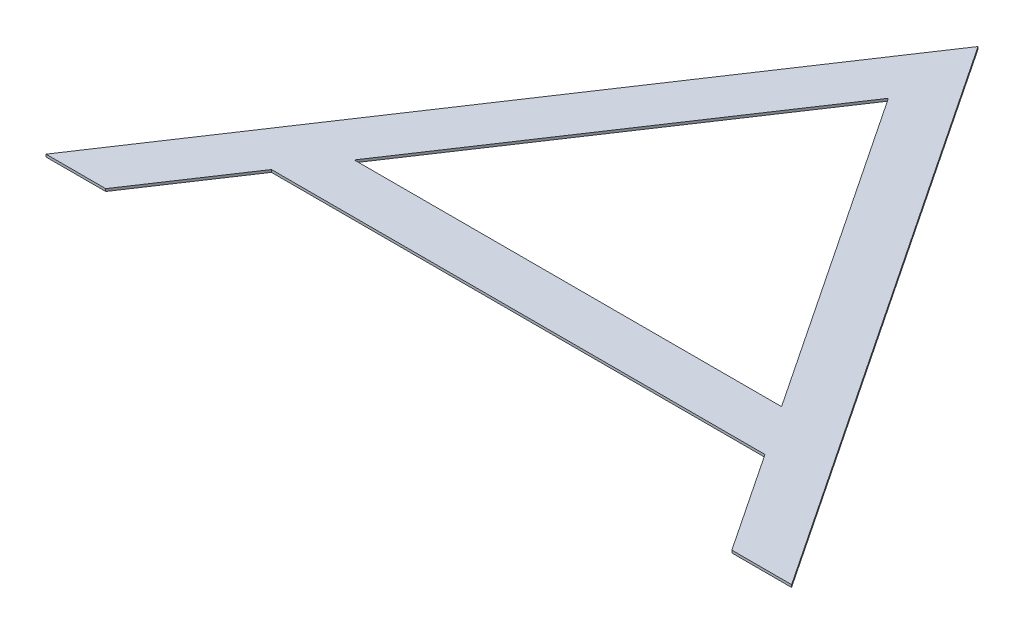
ISO-10303-21;
HEADER;
FILE_DESCRIPTION(('STEP AP214'),'2;1');
FILE_NAME('part.step','',(''),(''),'','','');
FILE_SCHEMA(('AUTOMOTIVE_DESIGN { 1 0 10303 214 1 1 1 1 }'));
ENDSEC;
DATA;
#1=APPLICATION_CONTEXT('core data for automotive mechanical design processes');
#2=APPLICATION_PROTOCOL_DEFINITION('international standard','automotive_design',2000,#1);
#3=PRODUCT_CONTEXT('',#1,'mechanical');
#4=PRODUCT('Part','Part','',(#3));
#5=PRODUCT_RELATED_PRODUCT_CATEGORY('part','',(#4));
#6=PRODUCT_DEFINITION_FORMATION('','',#4);
#7=PRODUCT_DEFINITION_CONTEXT('part definition',#1,'design');
#8=PRODUCT_DEFINITION('design','',#6,#7);
#9=PRODUCT_DEFINITION_SHAPE('','',#8);
#10=(LENGTH_UNIT() NAMED_UNIT(*) SI_UNIT(.MILLI.,.METRE.));
#11=(NAMED_UNIT(*) PLANE_ANGLE_UNIT() SI_UNIT($,.RADIAN.));
#12=(NAMED_UNIT(*) SI_UNIT($,.STERADIAN.) SOLID_ANGLE_UNIT());
#13=UNCERTAINTY_MEASURE_WITH_UNIT(LENGTH_MEASURE(1.E-05),#10,'distance_accuracy_value','');
#14=(GEOMETRIC_REPRESENTATION_CONTEXT(3) GLOBAL_UNCERTAINTY_ASSIGNED_CONTEXT((#13)) GLOBAL_UNIT_ASSIGNED_CONTEXT((#10,
#11,#12)) REPRESENTATION_CONTEXT('',''));
#15=CARTESIAN_POINT('',(0.,0.,0.));
#16=DIRECTION('',(0.,0.,1.));
#17=DIRECTION('',(1.,0.,0.));
#18=AXIS2_PLACEMENT_3D('',#15,#16,#17);
#19=CARTESIAN_POINT('',(0.,0.,0.));
#20=DIRECTION('',(0.,1.,0.));
#21=DIRECTION('',(0.,0.,1.));
#22=AXIS2_PLACEMENT_3D('',#19,#20,#21);
#23=PLANE('',#22);
#24=DIRECTION('',(0.554687188998878,0.,-0.832058965675224));
#25=VECTOR('',#24,1.);
#26=CARTESIAN_POINT('',(-221.506133163058,0.,-147.665753773256));
#27=LINE('',#26,#25);
#28=CARTESIAN_POINT('',(-319.946634678979,0.,0.));
#29=VERTEX_POINT('',#28);
#30=CARTESIAN_POINT('',(-252.215595501302,0.,-101.6));
#31=VERTEX_POINT('',#30);
#32=EDGE_CURVE('E130',#29,#31,#27,.T.);
#33=ORIENTED_EDGE('',*,*,#32,.F.);
#34=DIRECTION('',(-1.,0.,0.));
#35=VECTOR('',#34,1.);
#36=CARTESIAN_POINT('',(0.,0.,0.));
#37=LINE('',#36,#35);
#38=CARTESIAN_POINT('',(-381.,0.,0.));
#39=VERTEX_POINT('',#38);
#40=EDGE_CURVE('E133',#29,#39,#37,.T.);
#41=ORIENTED_EDGE('',*,*,#40,.T.);
#42=DIRECTION('',(0.554687188998878,0.,-0.832058965675224));
#43=VECTOR('',#42,1.);
#44=CARTESIAN_POINT('',(-263.774728619359,0.,-175.843862974399));
#45=LINE('',#44,#43);
#46=CARTESIAN_POINT('',(0.,0.,-571.519357594));
#47=VERTEX_POINT('',#46);
#48=EDGE_CURVE('E138',#39,#47,#45,.T.);
#49=ORIENTED_EDGE('',*,*,#48,.T.);
#50=DIRECTION('',(0.554687188998878,0.,0.832058965675224));
#51=VECTOR('',#50,1.);
#52=CARTESIAN_POINT('',(263.774728619359,0.,-175.843862974399));
#53=LINE('',#52,#51);
#54=CARTESIAN_POINT('',(381.,0.,0.));
#55=VERTEX_POINT('',#54);
#56=EDGE_CURVE('E143',#47,#55,#53,.T.);
#57=ORIENTED_EDGE('',*,*,#56,.T.);
#58=DIRECTION('',(-1.,0.,0.));
#59=VECTOR('',#58,1.);
#60=CARTESIAN_POINT('',(0.,0.,0.));
#61=LINE('',#60,#59);
#62=CARTESIAN_POINT('',(319.946634678979,0.,0.));
#63=VERTEX_POINT('',#62);
#64=EDGE_CURVE('E148',#55,#63,#61,.T.);
#65=ORIENTED_EDGE('',*,*,#64,.T.);
#66=DIRECTION('',(0.554687188998878,0.,0.832058965675224));
#67=VECTOR('',#66,1.);
#68=CARTESIAN_POINT('',(221.506133163058,0.,-147.665753773256));
#69=LINE('',#68,#67);
#70=CARTESIAN_POINT('',(252.215595501302,0.,-101.6));
#71=VERTEX_POINT('',#70);
#72=EDGE_CURVE('E156',#71,#63,#69,.T.);
#73=ORIENTED_EDGE('',*,*,#72,.F.);
#74=DIRECTION('',(-1.,0.,0.));
#75=VECTOR('',#74,1.);
#76=CARTESIAN_POINT('',(0.,0.,-101.6));
#77=LINE('',#76,#75);
#78=EDGE_CURVE('E158',#71,#31,#77,.T.);
#79=ORIENTED_EDGE('',*,*,#78,.T.);
#80=EDGE_LOOP('',(#33,#41,#49,#57,#65,#73,#79));
#81=FACE_BOUND('',#80,.T.);
#82=DIRECTION('',(0.554687188998878,0.,-0.832058965675224));
#83=VECTOR('',#82,1.);
#84=CARTESIAN_POINT('',(-221.506133163058,0.,-147.665753773256));
#85=LINE('',#84,#83);
#86=CARTESIAN_POINT('',(-218.350075912464,0.,-152.4));
#87=VERTEX_POINT('',#86);
#88=CARTESIAN_POINT('',(0.,0.,-479.936207653786));
#89=VERTEX_POINT('',#88);
#90=EDGE_CURVE('E93',#87,#89,#85,.T.);
#91=ORIENTED_EDGE('',*,*,#90,.F.);
#92=DIRECTION('',(1.,0.,0.));
#93=VECTOR('',#92,1.);
#94=CARTESIAN_POINT('',(0.,0.,-152.4));
#95=LINE('',#94,#93);
#96=CARTESIAN_POINT('',(218.350075912464,0.,-152.4));
#97=VERTEX_POINT('',#96);
#98=EDGE_CURVE('E95',#87,#97,#95,.T.);
#99=ORIENTED_EDGE('',*,*,#98,.T.);
#100=DIRECTION('',(0.554687188998878,0.,0.832058965675224));
#101=VECTOR('',#100,1.);
#102=CARTESIAN_POINT('',(221.506133163058,0.,-147.665753773256));
#103=LINE('',#102,#101);
#104=EDGE_CURVE('E19',#89,#97,#103,.T.);
#105=ORIENTED_EDGE('',*,*,#104,.F.);
#106=EDGE_LOOP('',(#91,#99,#105));
#107=FACE_BOUND('',#106,.T.);
#108=ADVANCED_FACE('F16',(#81,#107),#23,.F.);
#109=CARTESIAN_POINT('',(221.506133163058,2.54,-147.665753773256));
#110=DIRECTION('',(-0.832058965675224,0.,0.554687188998878));
#111=DIRECTION('',(0.554687188998878,0.,0.832058965675224));
#112=AXIS2_PLACEMENT_3D('',#109,#110,#111);
#113=PLANE('',#112);
#114=DIRECTION('',(0.554687188998878,0.,0.832058965675224));
#115=VECTOR('',#114,1.);
#116=CARTESIAN_POINT('',(0.,2.54,-479.936207653786));
#117=LINE('',#116,#115);
#118=CARTESIAN_POINT('',(0.,2.54,-479.936207653786));
#119=VERTEX_POINT('',#118);
#120=CARTESIAN_POINT('',(218.350075912464,2.54,-152.4));
#121=VERTEX_POINT('',#120);
#122=EDGE_CURVE('E103',#119,#121,#117,.T.);
#123=ORIENTED_EDGE('',*,*,#122,.F.);
#124=DIRECTION('',(0.,1.,0.));
#125=VECTOR('',#124,1.);
#126=CARTESIAN_POINT('',(0.,2.54,-479.936207653786));
#127=LINE('',#126,#125);
#128=EDGE_CURVE('E100',#89,#119,#127,.T.);
#129=ORIENTED_EDGE('',*,*,#128,.F.);
#130=ORIENTED_EDGE('',*,*,#104,.T.);
#131=DIRECTION('',(0.,1.,0.));
#132=VECTOR('',#131,1.);
#133=CARTESIAN_POINT('',(218.350075912464,2.54,-152.4));
#134=LINE('',#133,#132);
#135=EDGE_CURVE('E98',#97,#121,#134,.T.);
#136=ORIENTED_EDGE('',*,*,#135,.T.);
#137=EDGE_LOOP('',(#123,#129,#130,#136));
#138=FACE_BOUND('',#137,.T.);
#139=ADVANCED_FACE('F101',(#138),#113,.T.);
#140=CARTESIAN_POINT('',(0.,2.54,-152.4));
#141=DIRECTION('',(0.,0.,1.));
#142=DIRECTION('',(1.,0.,0.));
#143=AXIS2_PLACEMENT_3D('',#140,#141,#142);
#144=PLANE('',#143);
#145=DIRECTION('',(0.,1.,0.));
#146=VECTOR('',#145,1.);
#147=CARTESIAN_POINT('',(-218.350075912464,2.54,-152.4));
#148=LINE('',#147,#146);
#149=CARTESIAN_POINT('',(-218.350075912464,2.54,-152.4));
#150=VERTEX_POINT('',#149);
#151=EDGE_CURVE('E107',#150,#87,#148,.F.);
#152=ORIENTED_EDGE('',*,*,#151,.F.);
#153=DIRECTION('',(1.,0.,0.));
#154=VECTOR('',#153,1.);
#155=CARTESIAN_POINT('',(0.,2.54,-152.4));
#156=LINE('',#155,#154);
#157=EDGE_CURVE('E117',#121,#150,#156,.F.);
#158=ORIENTED_EDGE('',*,*,#157,.F.);
#159=ORIENTED_EDGE('',*,*,#135,.F.);
#160=ORIENTED_EDGE('',*,*,#98,.F.);
#161=EDGE_LOOP('',(#152,#158,#159,#160));
#162=FACE_BOUND('',#161,.T.);
#163=ADVANCED_FACE('F118',(#162),#144,.F.);
#164=CARTESIAN_POINT('',(-221.506133163058,2.54,-147.665753773256));
#165=DIRECTION('',(0.832058965675224,0.,0.554687188998878));
#166=DIRECTION('',(0.554687188998878,0.,-0.832058965675224));
#167=AXIS2_PLACEMENT_3D('',#164,#165,#166);
#168=PLANE('',#167);
#169=DIRECTION('',(0.554687188998878,0.,-0.832058965675224));
#170=VECTOR('',#169,1.);
#171=CARTESIAN_POINT('',(-218.350075912464,2.54,-152.4));
#172=LINE('',#171,#170);
#173=EDGE_CURVE('E120',#150,#119,#172,.T.);
#174=ORIENTED_EDGE('',*,*,#173,.F.);
#175=ORIENTED_EDGE('',*,*,#151,.T.);
#176=ORIENTED_EDGE('',*,*,#90,.T.);
#177=ORIENTED_EDGE('',*,*,#128,.T.);
#178=EDGE_LOOP('',(#174,#175,#176,#177));
#179=FACE_BOUND('',#178,.T.);
#180=ADVANCED_FACE('F110',(#179),#168,.T.);
#181=CARTESIAN_POINT('',(0.,2.54,-101.6));
#182=DIRECTION('',(0.,0.,-1.));
#183=DIRECTION('',(-1.,0.,0.));
#184=AXIS2_PLACEMENT_3D('',#181,#182,#183);
#185=PLANE('',#184);
#186=DIRECTION('',(0.,1.,0.));
#187=VECTOR('',#186,1.);
#188=CARTESIAN_POINT('',(252.215595501302,2.54,-101.6));
#189=LINE('',#188,#187);
#190=CARTESIAN_POINT('',(252.215595501302,2.54,-101.6));
#191=VERTEX_POINT('',#190);
#192=EDGE_CURVE('E153',#191,#71,#189,.F.);
#193=ORIENTED_EDGE('',*,*,#192,.F.);
#194=DIRECTION('',(1.,0.,0.));
#195=VECTOR('',#194,1.);
#196=CARTESIAN_POINT('',(0.,2.54,-101.6));
#197=LINE('',#196,#195);
#198=CARTESIAN_POINT('',(-252.215595501302,2.54,-101.6));
#199=VERTEX_POINT('',#198);
#200=EDGE_CURVE('E165',#199,#191,#197,.T.);
#201=ORIENTED_EDGE('',*,*,#200,.F.);
#202=DIRECTION('',(0.,1.,0.));
#203=VECTOR('',#202,1.);
#204=CARTESIAN_POINT('',(-252.215595501302,2.54,-101.6));
#205=LINE('',#204,#203);
#206=EDGE_CURVE('E124',#31,#199,#205,.T.);
#207=ORIENTED_EDGE('',*,*,#206,.F.);
#208=ORIENTED_EDGE('',*,*,#78,.F.);
#209=EDGE_LOOP('',(#193,#201,#207,#208));
#210=FACE_BOUND('',#209,.T.);
#211=ADVANCED_FACE('F163',(#210),#185,.F.);
#212=CARTESIAN_POINT('',(221.506133163058,2.54,-147.665753773256));
#213=DIRECTION('',(-0.832058965675224,0.,0.554687188998878));
#214=DIRECTION('',(0.554687188998878,0.,0.832058965675224));
#215=AXIS2_PLACEMENT_3D('',#212,#213,#214);
#216=PLANE('',#215);
#217=DIRECTION('',(0.554687188998877,0.,0.832058965675224));
#218=VECTOR('',#217,1.);
#219=CARTESIAN_POINT('',(252.215595501302,2.54,-101.6));
#220=LINE('',#219,#218);
#221=CARTESIAN_POINT('',(319.946634678979,2.54,0.));
#222=VERTEX_POINT('',#221);
#223=EDGE_CURVE('E183',#191,#222,#220,.T.);
#224=ORIENTED_EDGE('',*,*,#223,.F.);
#225=ORIENTED_EDGE('',*,*,#192,.T.);
#226=ORIENTED_EDGE('',*,*,#72,.T.);
#227=DIRECTION('',(0.,1.,0.));
#228=VECTOR('',#227,1.);
#229=CARTESIAN_POINT('',(319.946634678979,2.54,0.));
#230=LINE('',#229,#228);
#231=EDGE_CURVE('E151',#63,#222,#230,.T.);
#232=ORIENTED_EDGE('',*,*,#231,.T.);
#233=EDGE_LOOP('',(#224,#225,#226,#232));
#234=FACE_BOUND('',#233,.T.);
#235=ADVANCED_FACE('F189',(#234),#216,.T.);
#236=CARTESIAN_POINT('',(0.,2.54,0.));
#237=DIRECTION('',(0.,0.,-1.));
#238=DIRECTION('',(-1.,0.,0.));
#239=AXIS2_PLACEMENT_3D('',#236,#237,#238);
#240=PLANE('',#239);
#241=DIRECTION('',(0.,1.,0.));
#242=VECTOR('',#241,1.);
#243=CARTESIAN_POINT('',(381.,2.54,0.));
#244=LINE('',#243,#242);
#245=CARTESIAN_POINT('',(381.,2.54,0.));
#246=VERTEX_POINT('',#245);
#247=EDGE_CURVE('E146',#55,#246,#244,.T.);
#248=ORIENTED_EDGE('',*,*,#247,.T.);
#249=DIRECTION('',(1.,0.,0.));
#250=VECTOR('',#249,1.);
#251=CARTESIAN_POINT('',(0.,2.54,0.));
#252=LINE('',#251,#250);
#253=EDGE_CURVE('E180',#222,#246,#252,.T.);
#254=ORIENTED_EDGE('',*,*,#253,.F.);
#255=ORIENTED_EDGE('',*,*,#231,.F.);
#256=ORIENTED_EDGE('',*,*,#64,.F.);
#257=EDGE_LOOP('',(#248,#254,#255,#256));
#258=FACE_BOUND('',#257,.T.);
#259=ADVANCED_FACE('F192',(#258),#240,.F.);
#260=CARTESIAN_POINT('',(263.774728619359,2.54,-175.843862974399));
#261=DIRECTION('',(-0.832058965675224,0.,0.554687188998878));
#262=DIRECTION('',(0.554687188998878,0.,0.832058965675224));
#263=AXIS2_PLACEMENT_3D('',#260,#261,#262);
#264=PLANE('',#263);
#265=DIRECTION('',(0.,1.,0.));
#266=VECTOR('',#265,1.);
#267=CARTESIAN_POINT('',(0.,2.54,-571.519357594));
#268=LINE('',#267,#266);
#269=CARTESIAN_POINT('',(1.11556146976226E-13,2.54,-571.519357594));
#270=VERTEX_POINT('',#269);
#271=EDGE_CURVE('E141',#47,#270,#268,.T.);
#272=ORIENTED_EDGE('',*,*,#271,.T.);
#273=DIRECTION('',(-0.554687188998878,0.,-0.832058965675224));
#274=VECTOR('',#273,1.);
#275=CARTESIAN_POINT('',(381.,2.54,0.));
#276=LINE('',#275,#274);
#277=EDGE_CURVE('E176',#246,#270,#276,.T.);
#278=ORIENTED_EDGE('',*,*,#277,.F.);
#279=ORIENTED_EDGE('',*,*,#247,.F.);
#280=ORIENTED_EDGE('',*,*,#56,.F.);
#281=EDGE_LOOP('',(#272,#278,#279,#280));
#282=FACE_BOUND('',#281,.T.);
#283=ADVANCED_FACE('F196',(#282),#264,.F.);
#284=CARTESIAN_POINT('',(-263.774728619359,2.54,-175.843862974399));
#285=DIRECTION('',(0.832058965675224,0.,0.554687188998878));
#286=DIRECTION('',(0.554687188998878,0.,-0.832058965675224));
#287=AXIS2_PLACEMENT_3D('',#284,#285,#286);
#288=PLANE('',#287);
#289=DIRECTION('',(0.,1.,0.));
#290=VECTOR('',#289,1.);
#291=CARTESIAN_POINT('',(-381.,2.54,0.));
#292=LINE('',#291,#290);
#293=CARTESIAN_POINT('',(-381.,2.54,0.));
#294=VERTEX_POINT('',#293);
#295=EDGE_CURVE('E136',#39,#294,#292,.T.);
#296=ORIENTED_EDGE('',*,*,#295,.T.);
#297=DIRECTION('',(-0.554687188998878,0.,0.832058965675224));
#298=VECTOR('',#297,1.);
#299=CARTESIAN_POINT('',(1.11022302462516E-13,2.54,-571.519357594));
#300=LINE('',#299,#298);
#301=EDGE_CURVE('E173',#270,#294,#300,.T.);
#302=ORIENTED_EDGE('',*,*,#301,.F.);
#303=ORIENTED_EDGE('',*,*,#271,.F.);
#304=ORIENTED_EDGE('',*,*,#48,.F.);
#305=EDGE_LOOP('',(#296,#302,#303,#304));
#306=FACE_BOUND('',#305,.T.);
#307=ADVANCED_FACE('F199',(#306),#288,.F.);
#308=CARTESIAN_POINT('',(0.,2.54,0.));
#309=DIRECTION('',(0.,0.,-1.));
#310=DIRECTION('',(-1.,0.,0.));
#311=AXIS2_PLACEMENT_3D('',#308,#309,#310);
#312=PLANE('',#311);
#313=DIRECTION('',(0.,1.,0.));
#314=VECTOR('',#313,1.);
#315=CARTESIAN_POINT('',(-319.946634678979,2.54,0.));
#316=LINE('',#315,#314);
#317=CARTESIAN_POINT('',(-319.946634678979,2.54,0.));
#318=VERTEX_POINT('',#317);
#319=EDGE_CURVE('E34',#318,#29,#316,.F.);
#320=ORIENTED_EDGE('',*,*,#319,.F.);
#321=DIRECTION('',(1.,0.,0.));
#322=VECTOR('',#321,1.);
#323=CARTESIAN_POINT('',(0.,2.54,0.));
#324=LINE('',#323,#322);
#325=EDGE_CURVE('E25',#294,#318,#324,.T.);
#326=ORIENTED_EDGE('',*,*,#325,.F.);
#327=ORIENTED_EDGE('',*,*,#295,.F.);
#328=ORIENTED_EDGE('',*,*,#40,.F.);
#329=EDGE_LOOP('',(#320,#326,#327,#328));
#330=FACE_BOUND('',#329,.T.);
#331=ADVANCED_FACE('F200',(#330),#312,.F.);
#332=CARTESIAN_POINT('',(-221.506133163058,2.54,-147.665753773256));
#333=DIRECTION('',(0.832058965675224,0.,0.554687188998878));
#334=DIRECTION('',(0.554687188998878,0.,-0.832058965675224));
#335=AXIS2_PLACEMENT_3D('',#332,#333,#334);
#336=PLANE('',#335);
#337=DIRECTION('',(0.554687188998877,0.,-0.832058965675224));
#338=VECTOR('',#337,1.);
#339=CARTESIAN_POINT('',(-319.946634678979,2.54,0.));
#340=LINE('',#339,#338);
#341=EDGE_CURVE('E11',#318,#199,#340,.T.);
#342=ORIENTED_EDGE('',*,*,#341,.F.);
#343=ORIENTED_EDGE('',*,*,#319,.T.);
#344=ORIENTED_EDGE('',*,*,#32,.T.);
#345=ORIENTED_EDGE('',*,*,#206,.T.);
#346=EDGE_LOOP('',(#342,#343,#344,#345));
#347=FACE_BOUND('',#346,.T.);
#348=ADVANCED_FACE('F167',(#347),#336,.T.);
#349=CARTESIAN_POINT('',(0.,2.54,0.));
#350=DIRECTION('',(0.,1.,0.));
#351=DIRECTION('',(0.,0.,1.));
#352=AXIS2_PLACEMENT_3D('',#349,#350,#351);
#353=PLANE('',#352);
#354=ORIENTED_EDGE('',*,*,#325,.T.);
#355=ORIENTED_EDGE('',*,*,#341,.T.);
#356=ORIENTED_EDGE('',*,*,#200,.T.);
#357=ORIENTED_EDGE('',*,*,#223,.T.);
#358=ORIENTED_EDGE('',*,*,#253,.T.);
#359=ORIENTED_EDGE('',*,*,#277,.T.);
#360=ORIENTED_EDGE('',*,*,#301,.T.);
#361=EDGE_LOOP('',(#354,#355,#356,#357,#358,#359,#360));
#362=FACE_BOUND('',#361,.T.);
#363=ORIENTED_EDGE('',*,*,#157,.T.);
#364=ORIENTED_EDGE('',*,*,#173,.T.);
#365=ORIENTED_EDGE('',*,*,#122,.T.);
#366=EDGE_LOOP('',(#363,#364,#365));
#367=FACE_BOUND('',#366,.T.);
#368=ADVANCED_FACE('F122',(#362,#367),#353,.T.);
#369=CLOSED_SHELL('',(#108,#139,#163,#180,#211,#235,#259,#283,#307,#331,#348,#368));
#370=MANIFOLD_SOLID_BREP('B1',#369);
#371=ADVANCED_BREP_SHAPE_REPRESENTATION('',(#18,#370),#14);
#372=SHAPE_DEFINITION_REPRESENTATION(#9,#371);
ENDSEC;
END-ISO-10303-21;
